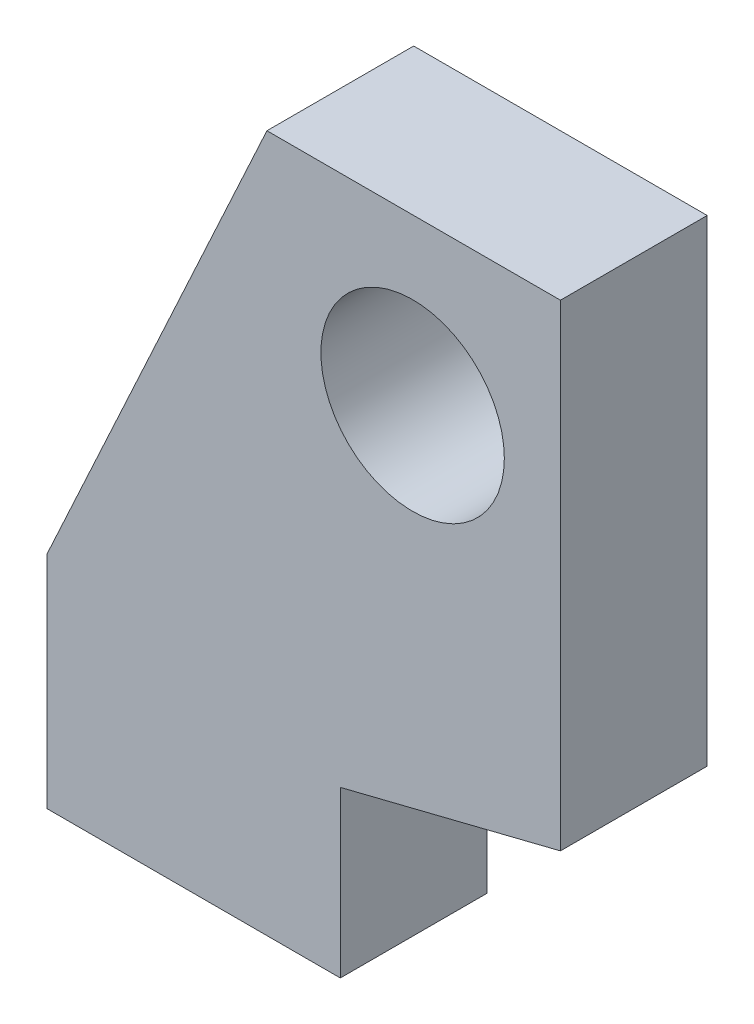
ISO-10303-21;
HEADER;
FILE_DESCRIPTION(('STEP AP214'),'2;1');
FILE_NAME('part.step','',(''),(''),'','','');
FILE_SCHEMA(('AUTOMOTIVE_DESIGN { 1 0 10303 214 1 1 1 1 }'));
ENDSEC;
DATA;
#1=APPLICATION_CONTEXT('core data for automotive mechanical design processes');
#2=APPLICATION_PROTOCOL_DEFINITION('international standard','automotive_design',2000,#1);
#3=PRODUCT_CONTEXT('',#1,'mechanical');
#4=PRODUCT('Part','Part','',(#3));
#5=PRODUCT_RELATED_PRODUCT_CATEGORY('part','',(#4));
#6=PRODUCT_DEFINITION_FORMATION('','',#4);
#7=PRODUCT_DEFINITION_CONTEXT('part definition',#1,'design');
#8=PRODUCT_DEFINITION('design','',#6,#7);
#9=PRODUCT_DEFINITION_SHAPE('','',#8);
#10=(LENGTH_UNIT() NAMED_UNIT(*) SI_UNIT(.MILLI.,.METRE.));
#11=(NAMED_UNIT(*) PLANE_ANGLE_UNIT() SI_UNIT($,.RADIAN.));
#12=(NAMED_UNIT(*) SI_UNIT($,.STERADIAN.) SOLID_ANGLE_UNIT());
#13=UNCERTAINTY_MEASURE_WITH_UNIT(LENGTH_MEASURE(1.E-05),#10,'distance_accuracy_value','');
#14=(GEOMETRIC_REPRESENTATION_CONTEXT(3) GLOBAL_UNCERTAINTY_ASSIGNED_CONTEXT((#13)) GLOBAL_UNIT_ASSIGNED_CONTEXT((#10,
#11,#12)) REPRESENTATION_CONTEXT('',''));
#15=CARTESIAN_POINT('',(0.,0.,0.));
#16=DIRECTION('',(0.,0.,1.));
#17=DIRECTION('',(1.,0.,0.));
#18=AXIS2_PLACEMENT_3D('',#15,#16,#17);
#19=CARTESIAN_POINT('',(3.970811984,8.5,4.));
#20=DIRECTION('',(0.,0.,-1.));
#21=DIRECTION('',(-1.,0.,0.));
#22=AXIS2_PLACEMENT_3D('',#19,#20,#21);
#23=CYLINDRICAL_SURFACE('',#22,2.5);
#24=CARTESIAN_POINT('',(3.970811984,8.5,4.));
#25=DIRECTION('',(0.,0.,1.));
#26=DIRECTION('',(1.,0.,0.));
#27=AXIS2_PLACEMENT_3D('',#24,#25,#26);
#28=CIRCLE('',#27,2.5);
#29=CARTESIAN_POINT('',(6.47081198400001,8.5,4.));
#30=VERTEX_POINT('',#29);
#31=EDGE_CURVE('E153',#30,#30,#28,.T.);
#32=ORIENTED_EDGE('',*,*,#31,.T.);
#33=EDGE_LOOP('',(#32));
#34=FACE_BOUND('',#33,.T.);
#35=CARTESIAN_POINT('',(3.970811984,8.5,0.));
#36=DIRECTION('',(0.,0.,1.));
#37=DIRECTION('',(1.,0.,0.));
#38=AXIS2_PLACEMENT_3D('',#35,#36,#37);
#39=CIRCLE('',#38,2.5);
#40=CARTESIAN_POINT('',(6.47081198400001,8.5,0.));
#41=VERTEX_POINT('',#40);
#42=EDGE_CURVE('E154',#41,#41,#39,.T.);
#43=ORIENTED_EDGE('',*,*,#42,.F.);
#44=EDGE_LOOP('',(#43));
#45=FACE_BOUND('',#44,.T.);
#46=ADVANCED_FACE('F74',(#34,#45),#23,.F.);
#47=CARTESIAN_POINT('',(0.470588235294118,-1.88235294117647,4.));
#48=DIRECTION('',(-0.242535625036333,0.970142500145332,0.));
#49=DIRECTION('',(-0.970142500145332,-0.242535625036333,0.));
#50=AXIS2_PLACEMENT_3D('',#47,#48,#49);
#51=PLANE('',#50);
#52=DIRECTION('',(0.,0.,1.));
#53=VECTOR('',#52,1.);
#54=CARTESIAN_POINT('',(2.,-1.5,4.));
#55=LINE('',#54,#53);
#56=CARTESIAN_POINT('',(2.,-1.5,0.));
#57=VERTEX_POINT('',#56);
#58=CARTESIAN_POINT('',(2.,-1.5,4.));
#59=VERTEX_POINT('',#58);
#60=EDGE_CURVE('E12',#57,#59,#55,.T.);
#61=ORIENTED_EDGE('',*,*,#60,.F.);
#62=DIRECTION('',(0.970142500145332,0.242535625036333,0.));
#63=VECTOR('',#62,1.);
#64=CARTESIAN_POINT('',(0.470588235294118,-1.88235294117647,0.));
#65=LINE('',#64,#63);
#66=CARTESIAN_POINT('',(8.,0.,0.));
#67=VERTEX_POINT('',#66);
#68=EDGE_CURVE('E119',#57,#67,#65,.T.);
#69=ORIENTED_EDGE('',*,*,#68,.T.);
#70=DIRECTION('',(0.,0.,-1.));
#71=VECTOR('',#70,1.);
#72=CARTESIAN_POINT('',(8.,0.,4.));
#73=LINE('',#72,#71);
#74=CARTESIAN_POINT('',(8.,0.,4.));
#75=VERTEX_POINT('',#74);
#76=EDGE_CURVE('E137',#75,#67,#73,.T.);
#77=ORIENTED_EDGE('',*,*,#76,.F.);
#78=DIRECTION('',(0.970142500145332,0.242535625036333,0.));
#79=VECTOR('',#78,1.);
#80=CARTESIAN_POINT('',(0.470588235294118,-1.88235294117647,4.));
#81=LINE('',#80,#79);
#82=EDGE_CURVE('E190',#59,#75,#81,.T.);
#83=ORIENTED_EDGE('',*,*,#82,.F.);
#84=EDGE_LOOP('',(#61,#69,#77,#83));
#85=FACE_BOUND('',#84,.T.);
#86=ADVANCED_FACE('F232',(#85),#51,.F.);
#87=CARTESIAN_POINT('',(8.,0.,4.));
#88=DIRECTION('',(-1.,0.,0.));
#89=DIRECTION('',(0.,0.,1.));
#90=AXIS2_PLACEMENT_3D('',#87,#88,#89);
#91=PLANE('',#90);
#92=DIRECTION('',(0.,1.,0.));
#93=VECTOR('',#92,1.);
#94=CARTESIAN_POINT('',(8.,0.,0.));
#95=LINE('',#94,#93);
#96=CARTESIAN_POINT('',(8.,13.,0.));
#97=VERTEX_POINT('',#96);
#98=EDGE_CURVE('E167',#67,#97,#95,.T.);
#99=ORIENTED_EDGE('',*,*,#98,.T.);
#100=DIRECTION('',(0.,0.,-1.));
#101=VECTOR('',#100,1.);
#102=CARTESIAN_POINT('',(8.,13.,4.));
#103=LINE('',#102,#101);
#104=CARTESIAN_POINT('',(8.,13.,4.));
#105=VERTEX_POINT('',#104);
#106=EDGE_CURVE('E141',#105,#97,#103,.T.);
#107=ORIENTED_EDGE('',*,*,#106,.F.);
#108=DIRECTION('',(0.,1.,0.));
#109=VECTOR('',#108,1.);
#110=CARTESIAN_POINT('',(8.,0.,4.));
#111=LINE('',#110,#109);
#112=EDGE_CURVE('E186',#75,#105,#111,.T.);
#113=ORIENTED_EDGE('',*,*,#112,.F.);
#114=ORIENTED_EDGE('',*,*,#76,.T.);
#115=EDGE_LOOP('',(#99,#107,#113,#114));
#116=FACE_BOUND('',#115,.T.);
#117=ADVANCED_FACE('F234',(#116),#91,.F.);
#118=CARTESIAN_POINT('',(0.,13.,4.));
#119=DIRECTION('',(0.,1.,0.));
#120=DIRECTION('',(0.,0.,1.));
#121=AXIS2_PLACEMENT_3D('',#118,#119,#120);
#122=PLANE('',#121);
#123=DIRECTION('',(1.,0.,0.));
#124=VECTOR('',#123,1.);
#125=CARTESIAN_POINT('',(0.,13.,0.));
#126=LINE('',#125,#124);
#127=CARTESIAN_POINT('',(0.,13.,0.));
#128=VERTEX_POINT('',#127);
#129=EDGE_CURVE('E163',#128,#97,#126,.T.);
#130=ORIENTED_EDGE('',*,*,#129,.F.);
#131=DIRECTION('',(0.,0.,-1.));
#132=VECTOR('',#131,1.);
#133=CARTESIAN_POINT('',(0.,13.,4.));
#134=LINE('',#133,#132);
#135=CARTESIAN_POINT('',(0.,13.,4.));
#136=VERTEX_POINT('',#135);
#137=EDGE_CURVE('E145',#136,#128,#134,.T.);
#138=ORIENTED_EDGE('',*,*,#137,.F.);
#139=DIRECTION('',(1.,0.,0.));
#140=VECTOR('',#139,1.);
#141=CARTESIAN_POINT('',(0.,13.,4.));
#142=LINE('',#141,#140);
#143=EDGE_CURVE('E182',#136,#105,#142,.T.);
#144=ORIENTED_EDGE('',*,*,#143,.T.);
#145=ORIENTED_EDGE('',*,*,#106,.T.);
#146=EDGE_LOOP('',(#130,#138,#144,#145));
#147=FACE_BOUND('',#146,.T.);
#148=ADVANCED_FACE('F219',(#147),#122,.T.);
#149=CARTESIAN_POINT('',(-4.94634146341463,2.28292682926829,4.));
#150=DIRECTION('',(-0.907959384500452,0.419058177461747,0.));
#151=DIRECTION('',(-0.419058177461747,-0.907959384500452,0.));
#152=AXIS2_PLACEMENT_3D('',#149,#150,#151);
#153=PLANE('',#152);
#154=DIRECTION('',(0.419058177461747,0.907959384500452,0.));
#155=VECTOR('',#154,1.);
#156=CARTESIAN_POINT('',(-4.94634146341463,2.28292682926829,0.));
#157=LINE('',#156,#155);
#158=CARTESIAN_POINT('',(-6.,0.,0.));
#159=VERTEX_POINT('',#158);
#160=EDGE_CURVE('E159',#159,#128,#157,.T.);
#161=ORIENTED_EDGE('',*,*,#160,.F.);
#162=DIRECTION('',(0.,0.,-1.));
#163=VECTOR('',#162,1.);
#164=CARTESIAN_POINT('',(-6.,0.,4.));
#165=LINE('',#164,#163);
#166=CARTESIAN_POINT('',(-6.,0.,4.));
#167=VERTEX_POINT('',#166);
#168=EDGE_CURVE('E149',#167,#159,#165,.T.);
#169=ORIENTED_EDGE('',*,*,#168,.F.);
#170=DIRECTION('',(0.419058177461747,0.907959384500452,0.));
#171=VECTOR('',#170,1.);
#172=CARTESIAN_POINT('',(-4.94634146341463,2.28292682926829,4.));
#173=LINE('',#172,#171);
#174=EDGE_CURVE('E178',#167,#136,#173,.T.);
#175=ORIENTED_EDGE('',*,*,#174,.T.);
#176=ORIENTED_EDGE('',*,*,#137,.T.);
#177=EDGE_LOOP('',(#161,#169,#175,#176));
#178=FACE_BOUND('',#177,.T.);
#179=ADVANCED_FACE('F212',(#178),#153,.T.);
#180=CARTESIAN_POINT('',(-6.,0.,4.));
#181=DIRECTION('',(1.,0.,0.));
#182=DIRECTION('',(0.,0.,-1.));
#183=AXIS2_PLACEMENT_3D('',#180,#181,#182);
#184=PLANE('',#183);
#185=DIRECTION('',(0.,-1.,0.));
#186=VECTOR('',#185,1.);
#187=CARTESIAN_POINT('',(-6.,0.,0.));
#188=LINE('',#187,#186);
#189=CARTESIAN_POINT('',(-6.,-6.,0.));
#190=VERTEX_POINT('',#189);
#191=EDGE_CURVE('E120',#159,#190,#188,.T.);
#192=ORIENTED_EDGE('',*,*,#191,.T.);
#193=DIRECTION('',(0.,0.,-1.));
#194=VECTOR('',#193,1.);
#195=CARTESIAN_POINT('',(-6.,-6.,4.));
#196=LINE('',#195,#194);
#197=CARTESIAN_POINT('',(-6.,-6.,4.));
#198=VERTEX_POINT('',#197);
#199=EDGE_CURVE('E84',#198,#190,#196,.T.);
#200=ORIENTED_EDGE('',*,*,#199,.F.);
#201=DIRECTION('',(0.,-1.,0.));
#202=VECTOR('',#201,1.);
#203=CARTESIAN_POINT('',(-6.,0.,4.));
#204=LINE('',#203,#202);
#205=EDGE_CURVE('E158',#167,#198,#204,.T.);
#206=ORIENTED_EDGE('',*,*,#205,.F.);
#207=ORIENTED_EDGE('',*,*,#168,.T.);
#208=EDGE_LOOP('',(#192,#200,#206,#207));
#209=FACE_BOUND('',#208,.T.);
#210=ADVANCED_FACE('F207',(#209),#184,.F.);
#211=CARTESIAN_POINT('',(0.,-6.,4.));
#212=DIRECTION('',(0.,1.,0.));
#213=DIRECTION('',(-1.,0.,0.));
#214=AXIS2_PLACEMENT_3D('',#211,#212,#213);
#215=PLANE('',#214);
#216=DIRECTION('',(1.,0.,0.));
#217=VECTOR('',#216,1.);
#218=CARTESIAN_POINT('',(0.,-6.,0.));
#219=LINE('',#218,#217);
#220=CARTESIAN_POINT('',(2.,-6.,0.));
#221=VERTEX_POINT('',#220);
#222=EDGE_CURVE('E109',#190,#221,#219,.T.);
#223=ORIENTED_EDGE('',*,*,#222,.T.);
#224=DIRECTION('',(0.,0.,-1.));
#225=VECTOR('',#224,1.);
#226=CARTESIAN_POINT('',(2.,-6.,4.));
#227=LINE('',#226,#225);
#228=CARTESIAN_POINT('',(2.,-6.,4.));
#229=VERTEX_POINT('',#228);
#230=EDGE_CURVE('E112',#229,#221,#227,.T.);
#231=ORIENTED_EDGE('',*,*,#230,.F.);
#232=DIRECTION('',(1.,0.,0.));
#233=VECTOR('',#232,1.);
#234=CARTESIAN_POINT('',(0.,-6.,4.));
#235=LINE('',#234,#233);
#236=EDGE_CURVE('E101',#198,#229,#235,.T.);
#237=ORIENTED_EDGE('',*,*,#236,.F.);
#238=ORIENTED_EDGE('',*,*,#199,.T.);
#239=EDGE_LOOP('',(#223,#231,#237,#238));
#240=FACE_BOUND('',#239,.T.);
#241=ADVANCED_FACE('F111',(#240),#215,.F.);
#242=CARTESIAN_POINT('',(0.,0.,0.));
#243=DIRECTION('',(0.,0.,1.));
#244=DIRECTION('',(1.,0.,0.));
#245=AXIS2_PLACEMENT_3D('',#242,#243,#244);
#246=PLANE('',#245);
#247=DIRECTION('',(0.,1.,0.));
#248=VECTOR('',#247,1.);
#249=CARTESIAN_POINT('',(2.,-6.,0.));
#250=LINE('',#249,#248);
#251=EDGE_CURVE('E122',#221,#57,#250,.T.);
#252=ORIENTED_EDGE('',*,*,#251,.F.);
#253=ORIENTED_EDGE('',*,*,#222,.F.);
#254=ORIENTED_EDGE('',*,*,#191,.F.);
#255=ORIENTED_EDGE('',*,*,#160,.T.);
#256=ORIENTED_EDGE('',*,*,#129,.T.);
#257=ORIENTED_EDGE('',*,*,#98,.F.);
#258=ORIENTED_EDGE('',*,*,#68,.F.);
#259=EDGE_LOOP('',(#252,#253,#254,#255,#256,#257,#258));
#260=FACE_BOUND('',#259,.T.);
#261=ORIENTED_EDGE('',*,*,#42,.T.);
#262=EDGE_LOOP('',(#261));
#263=FACE_BOUND('',#262,.T.);
#264=ADVANCED_FACE('F126',(#260,#263),#246,.F.);
#265=CARTESIAN_POINT('',(0.,0.,4.));
#266=DIRECTION('',(0.,0.,1.));
#267=DIRECTION('',(1.,0.,0.));
#268=AXIS2_PLACEMENT_3D('',#265,#266,#267);
#269=PLANE('',#268);
#270=ORIENTED_EDGE('',*,*,#236,.T.);
#271=DIRECTION('',(0.,1.,0.));
#272=VECTOR('',#271,1.);
#273=CARTESIAN_POINT('',(2.,-6.,4.));
#274=LINE('',#273,#272);
#275=EDGE_CURVE('E124',#229,#59,#274,.T.);
#276=ORIENTED_EDGE('',*,*,#275,.T.);
#277=ORIENTED_EDGE('',*,*,#82,.T.);
#278=ORIENTED_EDGE('',*,*,#112,.T.);
#279=ORIENTED_EDGE('',*,*,#143,.F.);
#280=ORIENTED_EDGE('',*,*,#174,.F.);
#281=ORIENTED_EDGE('',*,*,#205,.T.);
#282=EDGE_LOOP('',(#270,#276,#277,#278,#279,#280,#281));
#283=FACE_BOUND('',#282,.T.);
#284=ORIENTED_EDGE('',*,*,#31,.F.);
#285=EDGE_LOOP('',(#284));
#286=FACE_BOUND('',#285,.T.);
#287=ADVANCED_FACE('F200',(#283,#286),#269,.T.);
#288=CARTESIAN_POINT('',(2.,-6.,4.));
#289=DIRECTION('',(-1.,0.,0.));
#290=DIRECTION('',(0.,0.,1.));
#291=AXIS2_PLACEMENT_3D('',#288,#289,#290);
#292=PLANE('',#291);
#293=ORIENTED_EDGE('',*,*,#251,.T.);
#294=ORIENTED_EDGE('',*,*,#60,.T.);
#295=ORIENTED_EDGE('',*,*,#275,.F.);
#296=ORIENTED_EDGE('',*,*,#230,.T.);
#297=EDGE_LOOP('',(#293,#294,#295,#296));
#298=FACE_BOUND('',#297,.T.);
#299=ADVANCED_FACE('F76',(#298),#292,.F.);
#300=CLOSED_SHELL('',(#46,#86,#117,#148,#179,#210,#241,#264,#287,#299));
#301=MANIFOLD_SOLID_BREP('B2',#300);
#302=ADVANCED_BREP_SHAPE_REPRESENTATION('',(#18,#301),#14);
#303=SHAPE_DEFINITION_REPRESENTATION(#9,#302);
ENDSEC;
END-ISO-10303-21;
